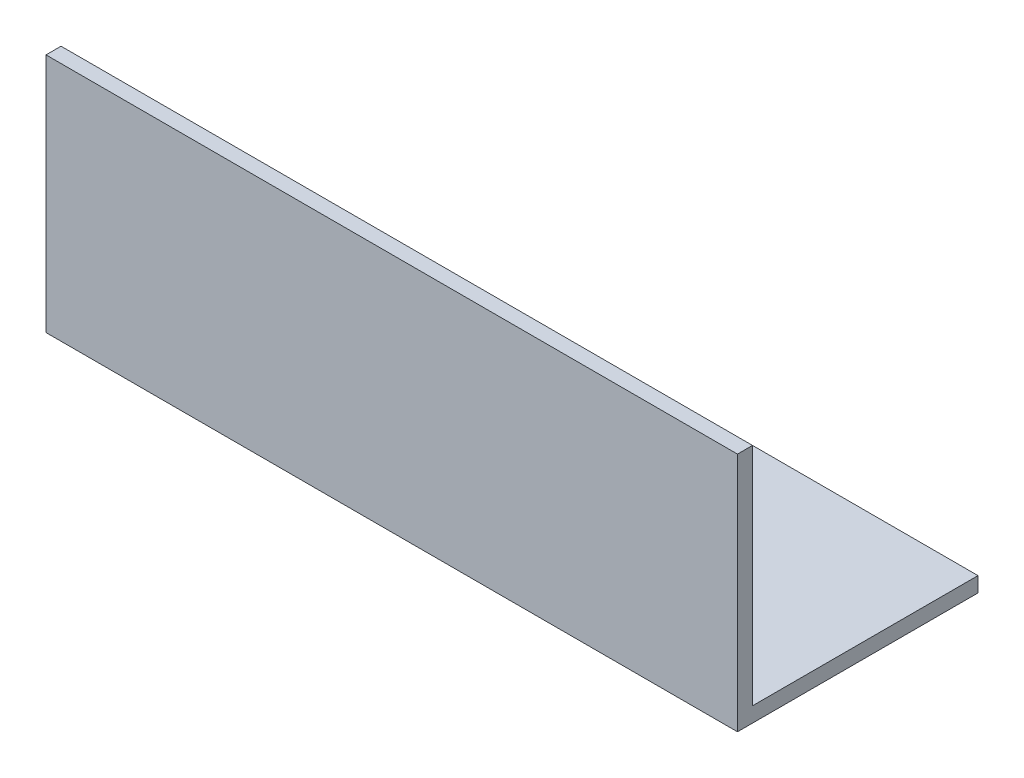
ISO-10303-21;
HEADER;
FILE_DESCRIPTION(('STEP AP214'),'2;1');
FILE_NAME('part.step','',(''),(''),'','','');
FILE_SCHEMA(('AUTOMOTIVE_DESIGN { 1 0 10303 214 1 1 1 1 }'));
ENDSEC;
DATA;
#1=APPLICATION_CONTEXT('core data for automotive mechanical design processes');
#2=APPLICATION_PROTOCOL_DEFINITION('international standard','automotive_design',2000,#1);
#3=PRODUCT_CONTEXT('',#1,'mechanical');
#4=PRODUCT('Part','Part','',(#3));
#5=PRODUCT_RELATED_PRODUCT_CATEGORY('part','',(#4));
#6=PRODUCT_DEFINITION_FORMATION('','',#4);
#7=PRODUCT_DEFINITION_CONTEXT('part definition',#1,'design');
#8=PRODUCT_DEFINITION('design','',#6,#7);
#9=PRODUCT_DEFINITION_SHAPE('','',#8);
#10=(LENGTH_UNIT() NAMED_UNIT(*) SI_UNIT(.MILLI.,.METRE.));
#11=(NAMED_UNIT(*) PLANE_ANGLE_UNIT() SI_UNIT($,.RADIAN.));
#12=(NAMED_UNIT(*) SI_UNIT($,.STERADIAN.) SOLID_ANGLE_UNIT());
#13=UNCERTAINTY_MEASURE_WITH_UNIT(LENGTH_MEASURE(1.E-05),#10,'distance_accuracy_value','');
#14=(GEOMETRIC_REPRESENTATION_CONTEXT(3) GLOBAL_UNCERTAINTY_ASSIGNED_CONTEXT((#13)) GLOBAL_UNIT_ASSIGNED_CONTEXT((#10,
#11,#12)) REPRESENTATION_CONTEXT('',''));
#15=CARTESIAN_POINT('',(0.,0.,0.));
#16=DIRECTION('',(0.,0.,1.));
#17=DIRECTION('',(1.,0.,0.));
#18=AXIS2_PLACEMENT_3D('',#15,#16,#17);
#19=CARTESIAN_POINT('',(230.,-5.,0.));
#20=DIRECTION('',(0.,1.,0.));
#21=DIRECTION('',(0.,0.,1.));
#22=AXIS2_PLACEMENT_3D('',#19,#20,#21);
#23=PLANE('',#22);
#24=DIRECTION('',(0.,0.,-1.));
#25=VECTOR('',#24,1.);
#26=CARTESIAN_POINT('',(0.,-5.,0.));
#27=LINE('',#26,#25);
#28=CARTESIAN_POINT('',(0.,-5.,5.));
#29=VERTEX_POINT('',#28);
#30=CARTESIAN_POINT('',(0.,-5.,-75.));
#31=VERTEX_POINT('',#30);
#32=EDGE_CURVE('E114',#29,#31,#27,.T.);
#33=ORIENTED_EDGE('',*,*,#32,.T.);
#34=DIRECTION('',(-1.,0.,0.));
#35=VECTOR('',#34,1.);
#36=CARTESIAN_POINT('',(230.,-5.,-75.));
#37=LINE('',#36,#35);
#38=CARTESIAN_POINT('',(230.,-5.,-75.));
#39=VERTEX_POINT('',#38);
#40=EDGE_CURVE('E11',#39,#31,#37,.T.);
#41=ORIENTED_EDGE('',*,*,#40,.F.);
#42=DIRECTION('',(0.,0.,-1.));
#43=VECTOR('',#42,1.);
#44=CARTESIAN_POINT('',(230.,-5.,0.));
#45=LINE('',#44,#43);
#46=CARTESIAN_POINT('',(230.,-5.,5.));
#47=VERTEX_POINT('',#46);
#48=EDGE_CURVE('E79',#47,#39,#45,.T.);
#49=ORIENTED_EDGE('',*,*,#48,.F.);
#50=DIRECTION('',(-1.,0.,0.));
#51=VECTOR('',#50,1.);
#52=CARTESIAN_POINT('',(230.,-5.,5.));
#53=LINE('',#52,#51);
#54=EDGE_CURVE('E110',#47,#29,#53,.T.);
#55=ORIENTED_EDGE('',*,*,#54,.T.);
#56=EDGE_LOOP('',(#33,#41,#49,#55));
#57=FACE_BOUND('',#56,.T.);
#58=ADVANCED_FACE('F33',(#57),#23,.F.);
#59=CARTESIAN_POINT('',(230.,0.,-75.));
#60=DIRECTION('',(0.,0.,-1.));
#61=DIRECTION('',(-1.,0.,0.));
#62=AXIS2_PLACEMENT_3D('',#59,#60,#61);
#63=PLANE('',#62);
#64=DIRECTION('',(0.,-1.,0.));
#65=VECTOR('',#64,1.);
#66=CARTESIAN_POINT('',(0.,0.,-75.));
#67=LINE('',#66,#65);
#68=CARTESIAN_POINT('',(0.,0.,-75.));
#69=VERTEX_POINT('',#68);
#70=EDGE_CURVE('E117',#69,#31,#67,.T.);
#71=ORIENTED_EDGE('',*,*,#70,.F.);
#72=DIRECTION('',(-1.,0.,0.));
#73=VECTOR('',#72,1.);
#74=CARTESIAN_POINT('',(230.,0.,-75.));
#75=LINE('',#74,#73);
#76=CARTESIAN_POINT('',(230.,0.,-75.));
#77=VERTEX_POINT('',#76);
#78=EDGE_CURVE('E41',#77,#69,#75,.T.);
#79=ORIENTED_EDGE('',*,*,#78,.F.);
#80=DIRECTION('',(0.,-1.,0.));
#81=VECTOR('',#80,1.);
#82=CARTESIAN_POINT('',(230.,0.,-75.));
#83=LINE('',#82,#81);
#84=EDGE_CURVE('E203',#77,#39,#83,.T.);
#85=ORIENTED_EDGE('',*,*,#84,.T.);
#86=ORIENTED_EDGE('',*,*,#40,.T.);
#87=EDGE_LOOP('',(#71,#79,#85,#86));
#88=FACE_BOUND('',#87,.T.);
#89=ADVANCED_FACE('F135',(#88),#63,.T.);
#90=CARTESIAN_POINT('',(230.,0.,0.));
#91=DIRECTION('',(0.,1.,0.));
#92=DIRECTION('',(0.,0.,1.));
#93=AXIS2_PLACEMENT_3D('',#90,#91,#92);
#94=PLANE('',#93);
#95=DIRECTION('',(0.,0.,-1.));
#96=VECTOR('',#95,1.);
#97=CARTESIAN_POINT('',(0.,0.,0.));
#98=LINE('',#97,#96);
#99=CARTESIAN_POINT('',(0.,0.,0.));
#100=VERTEX_POINT('',#99);
#101=EDGE_CURVE('E120',#100,#69,#98,.T.);
#102=ORIENTED_EDGE('',*,*,#101,.F.);
#103=DIRECTION('',(-1.,0.,0.));
#104=VECTOR('',#103,1.);
#105=CARTESIAN_POINT('',(230.,0.,0.));
#106=LINE('',#105,#104);
#107=CARTESIAN_POINT('',(230.,0.,0.));
#108=VERTEX_POINT('',#107);
#109=EDGE_CURVE('E100',#108,#100,#106,.T.);
#110=ORIENTED_EDGE('',*,*,#109,.F.);
#111=DIRECTION('',(0.,0.,-1.));
#112=VECTOR('',#111,1.);
#113=CARTESIAN_POINT('',(230.,0.,0.));
#114=LINE('',#113,#112);
#115=EDGE_CURVE('E106',#108,#77,#114,.T.);
#116=ORIENTED_EDGE('',*,*,#115,.T.);
#117=ORIENTED_EDGE('',*,*,#78,.T.);
#118=EDGE_LOOP('',(#102,#110,#116,#117));
#119=FACE_BOUND('',#118,.T.);
#120=ADVANCED_FACE('F132',(#119),#94,.T.);
#121=CARTESIAN_POINT('',(230.,0.,0.));
#122=DIRECTION('',(0.,0.,-1.));
#123=DIRECTION('',(-1.,0.,0.));
#124=AXIS2_PLACEMENT_3D('',#121,#122,#123);
#125=PLANE('',#124);
#126=DIRECTION('',(0.,-1.,0.));
#127=VECTOR('',#126,1.);
#128=CARTESIAN_POINT('',(0.,0.,0.));
#129=LINE('',#128,#127);
#130=CARTESIAN_POINT('',(0.,75.,0.));
#131=VERTEX_POINT('',#130);
#132=EDGE_CURVE('E95',#131,#100,#129,.T.);
#133=ORIENTED_EDGE('',*,*,#132,.F.);
#134=DIRECTION('',(-1.,0.,0.));
#135=VECTOR('',#134,1.);
#136=CARTESIAN_POINT('',(230.,75.,0.));
#137=LINE('',#136,#135);
#138=CARTESIAN_POINT('',(230.,75.,0.));
#139=VERTEX_POINT('',#138);
#140=EDGE_CURVE('E90',#139,#131,#137,.T.);
#141=ORIENTED_EDGE('',*,*,#140,.F.);
#142=DIRECTION('',(0.,-1.,0.));
#143=VECTOR('',#142,1.);
#144=CARTESIAN_POINT('',(230.,0.,0.));
#145=LINE('',#144,#143);
#146=EDGE_CURVE('E93',#139,#108,#145,.T.);
#147=ORIENTED_EDGE('',*,*,#146,.T.);
#148=ORIENTED_EDGE('',*,*,#109,.T.);
#149=EDGE_LOOP('',(#133,#141,#147,#148));
#150=FACE_BOUND('',#149,.T.);
#151=ADVANCED_FACE('F92',(#150),#125,.T.);
#152=CARTESIAN_POINT('',(230.,75.,5.));
#153=DIRECTION('',(0.,1.,0.));
#154=DIRECTION('',(0.,0.,1.));
#155=AXIS2_PLACEMENT_3D('',#152,#153,#154);
#156=PLANE('',#155);
#157=DIRECTION('',(0.,0.,-1.));
#158=VECTOR('',#157,1.);
#159=CARTESIAN_POINT('',(0.,75.,5.));
#160=LINE('',#159,#158);
#161=CARTESIAN_POINT('',(0.,75.,5.));
#162=VERTEX_POINT('',#161);
#163=EDGE_CURVE('E124',#162,#131,#160,.T.);
#164=ORIENTED_EDGE('',*,*,#163,.F.);
#165=DIRECTION('',(-1.,0.,0.));
#166=VECTOR('',#165,1.);
#167=CARTESIAN_POINT('',(230.,75.,5.));
#168=LINE('',#167,#166);
#169=CARTESIAN_POINT('',(230.,75.,5.));
#170=VERTEX_POINT('',#169);
#171=EDGE_CURVE('E70',#170,#162,#168,.T.);
#172=ORIENTED_EDGE('',*,*,#171,.F.);
#173=DIRECTION('',(0.,0.,-1.));
#174=VECTOR('',#173,1.);
#175=CARTESIAN_POINT('',(230.,75.,5.));
#176=LINE('',#175,#174);
#177=EDGE_CURVE('E104',#170,#139,#176,.T.);
#178=ORIENTED_EDGE('',*,*,#177,.T.);
#179=ORIENTED_EDGE('',*,*,#140,.T.);
#180=EDGE_LOOP('',(#164,#172,#178,#179));
#181=FACE_BOUND('',#180,.T.);
#182=ADVANCED_FACE('F108',(#181),#156,.T.);
#183=CARTESIAN_POINT('',(230.,0.,5.));
#184=DIRECTION('',(0.,0.,-1.));
#185=DIRECTION('',(-1.,0.,0.));
#186=AXIS2_PLACEMENT_3D('',#183,#184,#185);
#187=PLANE('',#186);
#188=DIRECTION('',(0.,1.,0.));
#189=VECTOR('',#188,1.);
#190=CARTESIAN_POINT('',(0.,0.,5.));
#191=LINE('',#190,#189);
#192=EDGE_CURVE('E73',#162,#29,#191,.F.);
#193=ORIENTED_EDGE('',*,*,#192,.T.);
#194=ORIENTED_EDGE('',*,*,#54,.F.);
#195=DIRECTION('',(0.,1.,0.));
#196=VECTOR('',#195,1.);
#197=CARTESIAN_POINT('',(230.,0.,5.));
#198=LINE('',#197,#196);
#199=EDGE_CURVE('E49',#170,#47,#198,.F.);
#200=ORIENTED_EDGE('',*,*,#199,.F.);
#201=ORIENTED_EDGE('',*,*,#171,.T.);
#202=EDGE_LOOP('',(#193,#194,#200,#201));
#203=FACE_BOUND('',#202,.T.);
#204=ADVANCED_FACE('F140',(#203),#187,.F.);
#205=CARTESIAN_POINT('',(230.,0.,0.));
#206=DIRECTION('',(-1.,0.,0.));
#207=DIRECTION('',(0.,0.,1.));
#208=AXIS2_PLACEMENT_3D('',#205,#206,#207);
#209=PLANE('',#208);
#210=ORIENTED_EDGE('',*,*,#48,.T.);
#211=ORIENTED_EDGE('',*,*,#84,.F.);
#212=ORIENTED_EDGE('',*,*,#115,.F.);
#213=ORIENTED_EDGE('',*,*,#146,.F.);
#214=ORIENTED_EDGE('',*,*,#177,.F.);
#215=ORIENTED_EDGE('',*,*,#199,.T.);
#216=EDGE_LOOP('',(#210,#211,#212,#213,#214,#215));
#217=FACE_BOUND('',#216,.T.);
#218=ADVANCED_FACE('F103',(#217),#209,.F.);
#219=CARTESIAN_POINT('',(0.,0.,0.));
#220=DIRECTION('',(-1.,0.,0.));
#221=DIRECTION('',(0.,0.,1.));
#222=AXIS2_PLACEMENT_3D('',#219,#220,#221);
#223=PLANE('',#222);
#224=ORIENTED_EDGE('',*,*,#32,.F.);
#225=ORIENTED_EDGE('',*,*,#192,.F.);
#226=ORIENTED_EDGE('',*,*,#163,.T.);
#227=ORIENTED_EDGE('',*,*,#132,.T.);
#228=ORIENTED_EDGE('',*,*,#101,.T.);
#229=ORIENTED_EDGE('',*,*,#70,.T.);
#230=EDGE_LOOP('',(#224,#225,#226,#227,#228,#229));
#231=FACE_BOUND('',#230,.T.);
#232=ADVANCED_FACE('F138',(#231),#223,.T.);
#233=CLOSED_SHELL('',(#58,#89,#120,#151,#182,#204,#218,#232));
#234=MANIFOLD_SOLID_BREP('B2',#233);
#235=ADVANCED_BREP_SHAPE_REPRESENTATION('',(#18,#234),#14);
#236=SHAPE_DEFINITION_REPRESENTATION(#9,#235);
ENDSEC;
END-ISO-10303-21;
